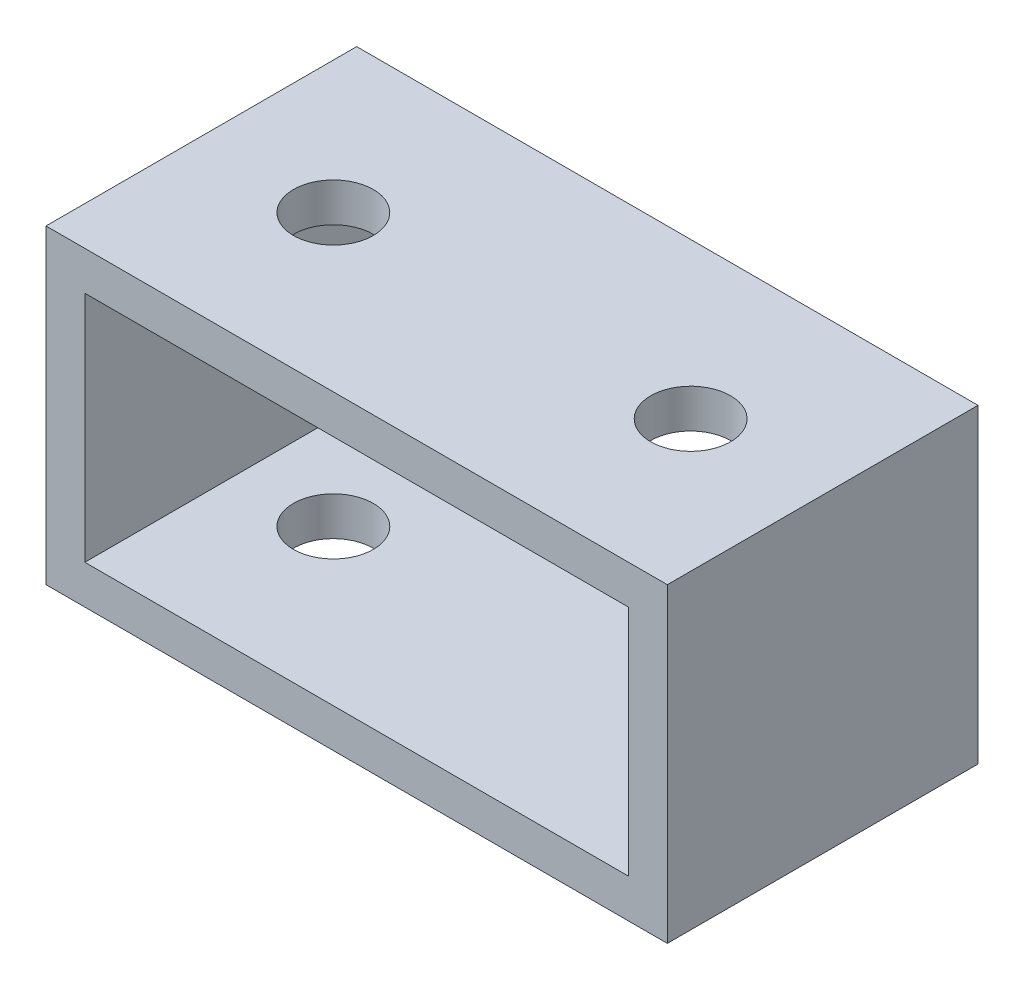
ISO-10303-21;
HEADER;
FILE_DESCRIPTION(('STEP AP214'),'2;1');
FILE_NAME('part.step','',(''),(''),'','','');
FILE_SCHEMA(('AUTOMOTIVE_DESIGN { 1 0 10303 214 1 1 1 1 }'));
ENDSEC;
DATA;
#1=APPLICATION_CONTEXT('core data for automotive mechanical design processes');
#2=APPLICATION_PROTOCOL_DEFINITION('international standard','automotive_design',2000,#1);
#3=PRODUCT_CONTEXT('',#1,'mechanical');
#4=PRODUCT('Part','Part','',(#3));
#5=PRODUCT_RELATED_PRODUCT_CATEGORY('part','',(#4));
#6=PRODUCT_DEFINITION_FORMATION('','',#4);
#7=PRODUCT_DEFINITION_CONTEXT('part definition',#1,'design');
#8=PRODUCT_DEFINITION('design','',#6,#7);
#9=PRODUCT_DEFINITION_SHAPE('','',#8);
#10=(LENGTH_UNIT() NAMED_UNIT(*) SI_UNIT(.MILLI.,.METRE.));
#11=(NAMED_UNIT(*) PLANE_ANGLE_UNIT() SI_UNIT($,.RADIAN.));
#12=(NAMED_UNIT(*) SI_UNIT($,.STERADIAN.) SOLID_ANGLE_UNIT());
#13=UNCERTAINTY_MEASURE_WITH_UNIT(LENGTH_MEASURE(1.E-05),#10,'distance_accuracy_value','');
#14=(GEOMETRIC_REPRESENTATION_CONTEXT(3) GLOBAL_UNCERTAINTY_ASSIGNED_CONTEXT((#13)) GLOBAL_UNIT_ASSIGNED_CONTEXT((#10,
#11,#12)) REPRESENTATION_CONTEXT('',''));
#15=CARTESIAN_POINT('',(0.,0.,0.));
#16=DIRECTION('',(0.,0.,1.));
#17=DIRECTION('',(1.,0.,0.));
#18=AXIS2_PLACEMENT_3D('',#15,#16,#17);
#19=CARTESIAN_POINT('',(0.,0.,25.4));
#20=DIRECTION('',(0.,0.,-1.));
#21=DIRECTION('',(-1.,0.,0.));
#22=AXIS2_PLACEMENT_3D('',#19,#20,#21);
#23=PLANE('',#22);
#24=DIRECTION('',(0.,-1.,0.));
#25=VECTOR('',#24,1.);
#26=CARTESIAN_POINT('',(0.,0.,25.4));
#27=LINE('',#26,#25);
#28=CARTESIAN_POINT('',(0.,25.4,25.4));
#29=VERTEX_POINT('',#28);
#30=CARTESIAN_POINT('',(0.,0.,25.4));
#31=VERTEX_POINT('',#30);
#32=EDGE_CURVE('E163',#29,#31,#27,.T.);
#33=ORIENTED_EDGE('',*,*,#32,.T.);
#34=DIRECTION('',(1.,0.,0.));
#35=VECTOR('',#34,1.);
#36=CARTESIAN_POINT('',(0.,0.,25.4));
#37=LINE('',#36,#35);
#38=CARTESIAN_POINT('',(50.8,0.,25.4));
#39=VERTEX_POINT('',#38);
#40=EDGE_CURVE('E167',#31,#39,#37,.T.);
#41=ORIENTED_EDGE('',*,*,#40,.T.);
#42=DIRECTION('',(0.,1.,0.));
#43=VECTOR('',#42,1.);
#44=CARTESIAN_POINT('',(50.8,0.,25.4));
#45=LINE('',#44,#43);
#46=CARTESIAN_POINT('',(50.8,25.4,25.4));
#47=VERTEX_POINT('',#46);
#48=EDGE_CURVE('E171',#39,#47,#45,.T.);
#49=ORIENTED_EDGE('',*,*,#48,.T.);
#50=DIRECTION('',(-1.,0.,0.));
#51=VECTOR('',#50,1.);
#52=CARTESIAN_POINT('',(0.,25.4,25.4));
#53=LINE('',#52,#51);
#54=EDGE_CURVE('E174',#47,#29,#53,.T.);
#55=ORIENTED_EDGE('',*,*,#54,.T.);
#56=EDGE_LOOP('',(#33,#41,#49,#55));
#57=FACE_BOUND('',#56,.T.);
#58=DIRECTION('',(1.,0.,0.));
#59=VECTOR('',#58,1.);
#60=CARTESIAN_POINT('',(3.175,3.175,25.4));
#61=LINE('',#60,#59);
#62=CARTESIAN_POINT('',(3.175,3.175,25.4));
#63=VERTEX_POINT('',#62);
#64=CARTESIAN_POINT('',(47.625,3.175,25.4));
#65=VERTEX_POINT('',#64);
#66=EDGE_CURVE('E113',#63,#65,#61,.T.);
#67=ORIENTED_EDGE('',*,*,#66,.F.);
#68=DIRECTION('',(0.,-1.,0.));
#69=VECTOR('',#68,1.);
#70=CARTESIAN_POINT('',(3.175,3.175,25.4));
#71=LINE('',#70,#69);
#72=CARTESIAN_POINT('',(3.175,22.225,25.4));
#73=VERTEX_POINT('',#72);
#74=EDGE_CURVE('E139',#73,#63,#71,.T.);
#75=ORIENTED_EDGE('',*,*,#74,.F.);
#76=DIRECTION('',(-1.,0.,0.));
#77=VECTOR('',#76,1.);
#78=CARTESIAN_POINT('',(3.175,22.225,25.4));
#79=LINE('',#78,#77);
#80=CARTESIAN_POINT('',(47.625,22.225,25.4));
#81=VERTEX_POINT('',#80);
#82=EDGE_CURVE('E135',#81,#73,#79,.T.);
#83=ORIENTED_EDGE('',*,*,#82,.F.);
#84=DIRECTION('',(0.,1.,0.));
#85=VECTOR('',#84,1.);
#86=CARTESIAN_POINT('',(47.625,3.175,25.4));
#87=LINE('',#86,#85);
#88=EDGE_CURVE('E122',#65,#81,#87,.T.);
#89=ORIENTED_EDGE('',*,*,#88,.F.);
#90=EDGE_LOOP('',(#67,#75,#83,#89));
#91=FACE_BOUND('',#90,.T.);
#92=ADVANCED_FACE('F45',(#57,#91),#23,.F.);
#93=CARTESIAN_POINT('',(0.,0.,0.));
#94=DIRECTION('',(0.,0.,-1.));
#95=DIRECTION('',(-1.,0.,0.));
#96=AXIS2_PLACEMENT_3D('',#93,#94,#95);
#97=PLANE('',#96);
#98=DIRECTION('',(0.,-1.,0.));
#99=VECTOR('',#98,1.);
#100=CARTESIAN_POINT('',(0.,0.,0.));
#101=LINE('',#100,#99);
#102=CARTESIAN_POINT('',(0.,25.4,0.));
#103=VERTEX_POINT('',#102);
#104=CARTESIAN_POINT('',(0.,0.,0.));
#105=VERTEX_POINT('',#104);
#106=EDGE_CURVE('E131',#103,#105,#101,.T.);
#107=ORIENTED_EDGE('',*,*,#106,.F.);
#108=DIRECTION('',(-1.,0.,0.));
#109=VECTOR('',#108,1.);
#110=CARTESIAN_POINT('',(0.,25.4,0.));
#111=LINE('',#110,#109);
#112=CARTESIAN_POINT('',(50.8,25.4,0.));
#113=VERTEX_POINT('',#112);
#114=EDGE_CURVE('E168',#113,#103,#111,.T.);
#115=ORIENTED_EDGE('',*,*,#114,.F.);
#116=DIRECTION('',(0.,1.,0.));
#117=VECTOR('',#116,1.);
#118=CARTESIAN_POINT('',(50.8,0.,0.));
#119=LINE('',#118,#117);
#120=CARTESIAN_POINT('',(50.8,0.,0.));
#121=VERTEX_POINT('',#120);
#122=EDGE_CURVE('E184',#121,#113,#119,.T.);
#123=ORIENTED_EDGE('',*,*,#122,.F.);
#124=DIRECTION('',(1.,0.,0.));
#125=VECTOR('',#124,1.);
#126=CARTESIAN_POINT('',(0.,0.,0.));
#127=LINE('',#126,#125);
#128=EDGE_CURVE('E181',#105,#121,#127,.T.);
#129=ORIENTED_EDGE('',*,*,#128,.F.);
#130=EDGE_LOOP('',(#107,#115,#123,#129));
#131=FACE_BOUND('',#130,.T.);
#132=DIRECTION('',(0.,-1.,0.));
#133=VECTOR('',#132,1.);
#134=CARTESIAN_POINT('',(3.175,3.175,0.));
#135=LINE('',#134,#133);
#136=CARTESIAN_POINT('',(3.175,22.225,0.));
#137=VERTEX_POINT('',#136);
#138=CARTESIAN_POINT('',(3.175,3.175,0.));
#139=VERTEX_POINT('',#138);
#140=EDGE_CURVE('E123',#137,#139,#135,.T.);
#141=ORIENTED_EDGE('',*,*,#140,.T.);
#142=DIRECTION('',(1.,0.,0.));
#143=VECTOR('',#142,1.);
#144=CARTESIAN_POINT('',(3.175,3.175,0.));
#145=LINE('',#144,#143);
#146=CARTESIAN_POINT('',(47.625,3.175,0.));
#147=VERTEX_POINT('',#146);
#148=EDGE_CURVE('E71',#139,#147,#145,.T.);
#149=ORIENTED_EDGE('',*,*,#148,.T.);
#150=DIRECTION('',(0.,1.,0.));
#151=VECTOR('',#150,1.);
#152=CARTESIAN_POINT('',(47.625,3.175,0.));
#153=LINE('',#152,#151);
#154=CARTESIAN_POINT('',(47.625,22.225,0.));
#155=VERTEX_POINT('',#154);
#156=EDGE_CURVE('E129',#147,#155,#153,.T.);
#157=ORIENTED_EDGE('',*,*,#156,.T.);
#158=DIRECTION('',(-1.,0.,0.));
#159=VECTOR('',#158,1.);
#160=CARTESIAN_POINT('',(3.175,22.225,0.));
#161=LINE('',#160,#159);
#162=EDGE_CURVE('E150',#155,#137,#161,.T.);
#163=ORIENTED_EDGE('',*,*,#162,.T.);
#164=EDGE_LOOP('',(#141,#149,#157,#163));
#165=FACE_BOUND('',#164,.T.);
#166=ADVANCED_FACE('F250',(#131,#165),#97,.T.);
#167=CARTESIAN_POINT('',(0.,0.,25.4));
#168=DIRECTION('',(1.,0.,0.));
#169=DIRECTION('',(0.,0.,-1.));
#170=AXIS2_PLACEMENT_3D('',#167,#168,#169);
#171=PLANE('',#170);
#172=ORIENTED_EDGE('',*,*,#106,.T.);
#173=DIRECTION('',(0.,0.,-1.));
#174=VECTOR('',#173,1.);
#175=CARTESIAN_POINT('',(0.,0.,25.4));
#176=LINE('',#175,#174);
#177=EDGE_CURVE('E11',#31,#105,#176,.T.);
#178=ORIENTED_EDGE('',*,*,#177,.F.);
#179=ORIENTED_EDGE('',*,*,#32,.F.);
#180=DIRECTION('',(0.,0.,-1.));
#181=VECTOR('',#180,1.);
#182=CARTESIAN_POINT('',(0.,25.4,25.4));
#183=LINE('',#182,#181);
#184=EDGE_CURVE('E177',#29,#103,#183,.T.);
#185=ORIENTED_EDGE('',*,*,#184,.T.);
#186=EDGE_LOOP('',(#172,#178,#179,#185));
#187=FACE_BOUND('',#186,.T.);
#188=ADVANCED_FACE('F47',(#187),#171,.F.);
#189=CARTESIAN_POINT('',(0.,0.,25.4));
#190=DIRECTION('',(0.,1.,0.));
#191=DIRECTION('',(0.,0.,1.));
#192=AXIS2_PLACEMENT_3D('',#189,#190,#191);
#193=PLANE('',#192);
#194=CARTESIAN_POINT('',(10.795,0.,12.7));
#195=DIRECTION('',(0.,1.,0.));
#196=DIRECTION('',(0.,0.,1.));
#197=AXIS2_PLACEMENT_3D('',#194,#195,#196);
#198=CIRCLE('',#197,3.2639);
#199=CARTESIAN_POINT('',(10.795,0.,15.9639));
#200=VERTEX_POINT('',#199);
#201=EDGE_CURVE('E202',#200,#200,#198,.T.);
#202=ORIENTED_EDGE('',*,*,#201,.T.);
#203=EDGE_LOOP('',(#202));
#204=FACE_BOUND('',#203,.T.);
#205=CARTESIAN_POINT('',(40.005,0.,12.7));
#206=DIRECTION('',(0.,1.,0.));
#207=DIRECTION('',(0.,0.,1.));
#208=AXIS2_PLACEMENT_3D('',#205,#206,#207);
#209=CIRCLE('',#208,3.2639);
#210=CARTESIAN_POINT('',(40.005,0.,15.9639));
#211=VERTEX_POINT('',#210);
#212=EDGE_CURVE('E211',#211,#211,#209,.T.);
#213=ORIENTED_EDGE('',*,*,#212,.T.);
#214=EDGE_LOOP('',(#213));
#215=FACE_BOUND('',#214,.T.);
#216=ORIENTED_EDGE('',*,*,#128,.T.);
#217=DIRECTION('',(0.,0.,-1.));
#218=VECTOR('',#217,1.);
#219=CARTESIAN_POINT('',(50.8,0.,25.4));
#220=LINE('',#219,#218);
#221=EDGE_CURVE('E55',#39,#121,#220,.T.);
#222=ORIENTED_EDGE('',*,*,#221,.F.);
#223=ORIENTED_EDGE('',*,*,#40,.F.);
#224=ORIENTED_EDGE('',*,*,#177,.T.);
#225=EDGE_LOOP('',(#216,#222,#223,#224));
#226=FACE_BOUND('',#225,.T.);
#227=ADVANCED_FACE('F265',(#204,#215,#226),#193,.F.);
#228=CARTESIAN_POINT('',(50.8,0.,25.4));
#229=DIRECTION('',(-1.,0.,0.));
#230=DIRECTION('',(0.,0.,1.));
#231=AXIS2_PLACEMENT_3D('',#228,#229,#230);
#232=PLANE('',#231);
#233=ORIENTED_EDGE('',*,*,#122,.T.);
#234=DIRECTION('',(0.,0.,-1.));
#235=VECTOR('',#234,1.);
#236=CARTESIAN_POINT('',(50.8,25.4,25.4));
#237=LINE('',#236,#235);
#238=EDGE_CURVE('E192',#47,#113,#237,.T.);
#239=ORIENTED_EDGE('',*,*,#238,.F.);
#240=ORIENTED_EDGE('',*,*,#48,.F.);
#241=ORIENTED_EDGE('',*,*,#221,.T.);
#242=EDGE_LOOP('',(#233,#239,#240,#241));
#243=FACE_BOUND('',#242,.T.);
#244=ADVANCED_FACE('F263',(#243),#232,.F.);
#245=CARTESIAN_POINT('',(0.,25.4,25.4));
#246=DIRECTION('',(0.,-1.,0.));
#247=DIRECTION('',(0.,0.,-1.));
#248=AXIS2_PLACEMENT_3D('',#245,#246,#247);
#249=PLANE('',#248);
#250=CARTESIAN_POINT('',(10.795,25.4,12.7));
#251=DIRECTION('',(0.,-1.,0.));
#252=DIRECTION('',(0.,0.,-1.));
#253=AXIS2_PLACEMENT_3D('',#250,#251,#252);
#254=CIRCLE('',#253,3.2639);
#255=CARTESIAN_POINT('',(10.795,25.4,9.4361));
#256=VERTEX_POINT('',#255);
#257=EDGE_CURVE('E147',#256,#256,#254,.T.);
#258=ORIENTED_EDGE('',*,*,#257,.T.);
#259=EDGE_LOOP('',(#258));
#260=FACE_BOUND('',#259,.T.);
#261=CARTESIAN_POINT('',(40.005,25.4,12.7));
#262=DIRECTION('',(0.,-1.,0.));
#263=DIRECTION('',(0.,0.,-1.));
#264=AXIS2_PLACEMENT_3D('',#261,#262,#263);
#265=CIRCLE('',#264,3.2639);
#266=CARTESIAN_POINT('',(40.005,25.4,9.4361));
#267=VERTEX_POINT('',#266);
#268=EDGE_CURVE('E208',#267,#267,#265,.T.);
#269=ORIENTED_EDGE('',*,*,#268,.T.);
#270=EDGE_LOOP('',(#269));
#271=FACE_BOUND('',#270,.T.);
#272=ORIENTED_EDGE('',*,*,#114,.T.);
#273=ORIENTED_EDGE('',*,*,#184,.F.);
#274=ORIENTED_EDGE('',*,*,#54,.F.);
#275=ORIENTED_EDGE('',*,*,#238,.T.);
#276=EDGE_LOOP('',(#272,#273,#274,#275));
#277=FACE_BOUND('',#276,.T.);
#278=ADVANCED_FACE('F229',(#260,#271,#277),#249,.F.);
#279=CARTESIAN_POINT('',(3.175,3.175,25.4));
#280=DIRECTION('',(0.,1.,0.));
#281=DIRECTION('',(0.,0.,1.));
#282=AXIS2_PLACEMENT_3D('',#279,#280,#281);
#283=PLANE('',#282);
#284=CARTESIAN_POINT('',(10.795,3.175,12.7));
#285=DIRECTION('',(0.,1.,0.));
#286=DIRECTION('',(0.,0.,1.));
#287=AXIS2_PLACEMENT_3D('',#284,#285,#286);
#288=CIRCLE('',#287,3.2639);
#289=CARTESIAN_POINT('',(10.795,3.175,15.9639));
#290=VERTEX_POINT('',#289);
#291=EDGE_CURVE('E222',#290,#290,#288,.T.);
#292=ORIENTED_EDGE('',*,*,#291,.F.);
#293=EDGE_LOOP('',(#292));
#294=FACE_BOUND('',#293,.T.);
#295=CARTESIAN_POINT('',(40.005,3.175,12.7));
#296=DIRECTION('',(0.,1.,0.));
#297=DIRECTION('',(0.,0.,1.));
#298=AXIS2_PLACEMENT_3D('',#295,#296,#297);
#299=CIRCLE('',#298,3.2639);
#300=CARTESIAN_POINT('',(40.005,3.175,15.9639));
#301=VERTEX_POINT('',#300);
#302=EDGE_CURVE('E201',#301,#301,#299,.T.);
#303=ORIENTED_EDGE('',*,*,#302,.F.);
#304=EDGE_LOOP('',(#303));
#305=FACE_BOUND('',#304,.T.);
#306=ORIENTED_EDGE('',*,*,#148,.F.);
#307=DIRECTION('',(0.,0.,-1.));
#308=VECTOR('',#307,1.);
#309=CARTESIAN_POINT('',(3.175,3.175,25.4));
#310=LINE('',#309,#308);
#311=EDGE_CURVE('E117',#63,#139,#310,.T.);
#312=ORIENTED_EDGE('',*,*,#311,.F.);
#313=ORIENTED_EDGE('',*,*,#66,.T.);
#314=DIRECTION('',(0.,0.,-1.));
#315=VECTOR('',#314,1.);
#316=CARTESIAN_POINT('',(47.625,3.175,25.4));
#317=LINE('',#316,#315);
#318=EDGE_CURVE('E116',#65,#147,#317,.T.);
#319=ORIENTED_EDGE('',*,*,#318,.T.);
#320=EDGE_LOOP('',(#306,#312,#313,#319));
#321=FACE_BOUND('',#320,.T.);
#322=ADVANCED_FACE('F115',(#294,#305,#321),#283,.T.);
#323=CARTESIAN_POINT('',(47.625,3.175,25.4));
#324=DIRECTION('',(-1.,0.,0.));
#325=DIRECTION('',(0.,0.,1.));
#326=AXIS2_PLACEMENT_3D('',#323,#324,#325);
#327=PLANE('',#326);
#328=ORIENTED_EDGE('',*,*,#156,.F.);
#329=ORIENTED_EDGE('',*,*,#318,.F.);
#330=ORIENTED_EDGE('',*,*,#88,.T.);
#331=DIRECTION('',(0.,0.,-1.));
#332=VECTOR('',#331,1.);
#333=CARTESIAN_POINT('',(47.625,22.225,25.4));
#334=LINE('',#333,#332);
#335=EDGE_CURVE('E132',#81,#155,#334,.T.);
#336=ORIENTED_EDGE('',*,*,#335,.T.);
#337=EDGE_LOOP('',(#328,#329,#330,#336));
#338=FACE_BOUND('',#337,.T.);
#339=ADVANCED_FACE('F126',(#338),#327,.T.);
#340=CARTESIAN_POINT('',(3.175,22.225,25.4));
#341=DIRECTION('',(0.,-1.,0.));
#342=DIRECTION('',(0.,0.,-1.));
#343=AXIS2_PLACEMENT_3D('',#340,#341,#342);
#344=PLANE('',#343);
#345=CARTESIAN_POINT('',(10.795,22.225,12.7));
#346=DIRECTION('',(0.,-1.,0.));
#347=DIRECTION('',(0.,0.,-1.));
#348=AXIS2_PLACEMENT_3D('',#345,#346,#347);
#349=CIRCLE('',#348,3.2639);
#350=CARTESIAN_POINT('',(10.795,22.225,9.4361));
#351=VERTEX_POINT('',#350);
#352=EDGE_CURVE('E49',#351,#351,#349,.T.);
#353=ORIENTED_EDGE('',*,*,#352,.F.);
#354=EDGE_LOOP('',(#353));
#355=FACE_BOUND('',#354,.T.);
#356=CARTESIAN_POINT('',(40.005,22.225,12.7));
#357=DIRECTION('',(0.,-1.,0.));
#358=DIRECTION('',(0.,0.,-1.));
#359=AXIS2_PLACEMENT_3D('',#356,#357,#358);
#360=CIRCLE('',#359,3.2639);
#361=CARTESIAN_POINT('',(40.005,22.225,9.4361));
#362=VERTEX_POINT('',#361);
#363=EDGE_CURVE('E198',#362,#362,#360,.T.);
#364=ORIENTED_EDGE('',*,*,#363,.F.);
#365=EDGE_LOOP('',(#364));
#366=FACE_BOUND('',#365,.T.);
#367=ORIENTED_EDGE('',*,*,#162,.F.);
#368=ORIENTED_EDGE('',*,*,#335,.F.);
#369=ORIENTED_EDGE('',*,*,#82,.T.);
#370=DIRECTION('',(0.,0.,-1.));
#371=VECTOR('',#370,1.);
#372=CARTESIAN_POINT('',(3.175,22.225,25.4));
#373=LINE('',#372,#371);
#374=EDGE_CURVE('E63',#73,#137,#373,.T.);
#375=ORIENTED_EDGE('',*,*,#374,.T.);
#376=EDGE_LOOP('',(#367,#368,#369,#375));
#377=FACE_BOUND('',#376,.T.);
#378=ADVANCED_FACE('F289',(#355,#366,#377),#344,.T.);
#379=CARTESIAN_POINT('',(3.175,3.175,25.4));
#380=DIRECTION('',(1.,0.,0.));
#381=DIRECTION('',(0.,0.,-1.));
#382=AXIS2_PLACEMENT_3D('',#379,#380,#381);
#383=PLANE('',#382);
#384=ORIENTED_EDGE('',*,*,#140,.F.);
#385=ORIENTED_EDGE('',*,*,#374,.F.);
#386=ORIENTED_EDGE('',*,*,#74,.T.);
#387=ORIENTED_EDGE('',*,*,#311,.T.);
#388=EDGE_LOOP('',(#384,#385,#386,#387));
#389=FACE_BOUND('',#388,.T.);
#390=ADVANCED_FACE('F245',(#389),#383,.T.);
#391=CARTESIAN_POINT('',(40.005,0.,12.7));
#392=DIRECTION('',(0.,1.,0.));
#393=DIRECTION('',(0.,0.,1.));
#394=AXIS2_PLACEMENT_3D('',#391,#392,#393);
#395=CYLINDRICAL_SURFACE('',#394,3.2639);
#396=ORIENTED_EDGE('',*,*,#363,.T.);
#397=EDGE_LOOP('',(#396));
#398=FACE_BOUND('',#397,.T.);
#399=ORIENTED_EDGE('',*,*,#268,.F.);
#400=EDGE_LOOP('',(#399));
#401=FACE_BOUND('',#400,.T.);
#402=ADVANCED_FACE('F235',(#398,#401),#395,.F.);
#403=CARTESIAN_POINT('',(10.795,0.,12.7));
#404=DIRECTION('',(0.,1.,0.));
#405=DIRECTION('',(0.,0.,1.));
#406=AXIS2_PLACEMENT_3D('',#403,#404,#405);
#407=CYLINDRICAL_SURFACE('',#406,3.2639);
#408=ORIENTED_EDGE('',*,*,#352,.T.);
#409=EDGE_LOOP('',(#408));
#410=FACE_BOUND('',#409,.T.);
#411=ORIENTED_EDGE('',*,*,#257,.F.);
#412=EDGE_LOOP('',(#411));
#413=FACE_BOUND('',#412,.T.);
#414=ADVANCED_FACE('F232',(#410,#413),#407,.F.);
#415=ORIENTED_EDGE('',*,*,#302,.T.);
#416=EDGE_LOOP('',(#415));
#417=FACE_BOUND('',#416,.T.);
#418=ORIENTED_EDGE('',*,*,#212,.F.);
#419=EDGE_LOOP('',(#418));
#420=FACE_BOUND('',#419,.T.);
#421=ADVANCED_FACE('F234',(#417,#420),#395,.F.);
#422=ORIENTED_EDGE('',*,*,#291,.T.);
#423=EDGE_LOOP('',(#422));
#424=FACE_BOUND('',#423,.T.);
#425=ORIENTED_EDGE('',*,*,#201,.F.);
#426=EDGE_LOOP('',(#425));
#427=FACE_BOUND('',#426,.T.);
#428=ADVANCED_FACE('F238',(#424,#427),#407,.F.);
#429=CLOSED_SHELL('',(#92,#166,#188,#227,#244,#278,#322,#339,#378,#390,#402,#414,#421,#428));
#430=MANIFOLD_SOLID_BREP('B2',#429);
#431=ADVANCED_BREP_SHAPE_REPRESENTATION('',(#18,#430),#14);
#432=SHAPE_DEFINITION_REPRESENTATION(#9,#431);
ENDSEC;
END-ISO-10303-21;
